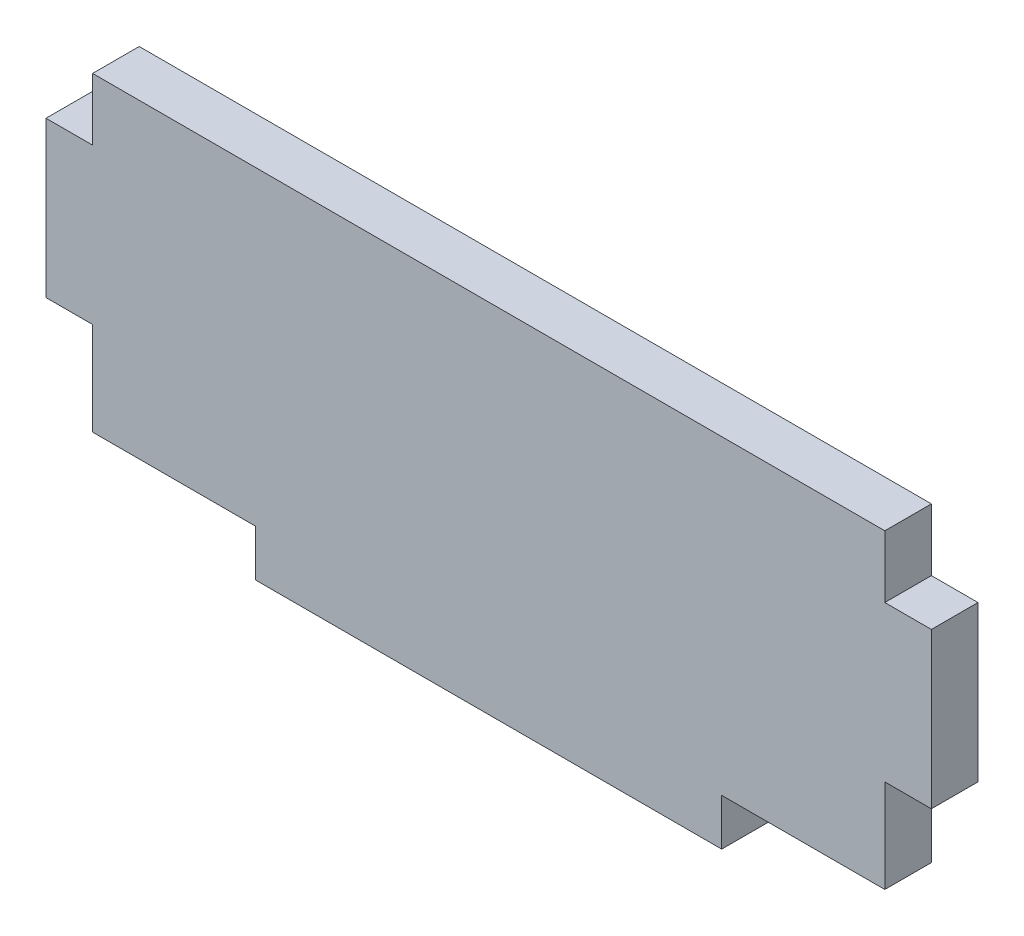
ISO-10303-21;
HEADER;
FILE_DESCRIPTION(('STEP AP214'),'2;1');
FILE_NAME('part.step','',(''),(''),'','','');
FILE_SCHEMA(('AUTOMOTIVE_DESIGN { 1 0 10303 214 1 1 1 1 }'));
ENDSEC;
DATA;
#1=APPLICATION_CONTEXT('core data for automotive mechanical design processes');
#2=APPLICATION_PROTOCOL_DEFINITION('international standard','automotive_design',2000,#1);
#3=PRODUCT_CONTEXT('',#1,'mechanical');
#4=PRODUCT('Part','Part','',(#3));
#5=PRODUCT_RELATED_PRODUCT_CATEGORY('part','',(#4));
#6=PRODUCT_DEFINITION_FORMATION('','',#4);
#7=PRODUCT_DEFINITION_CONTEXT('part definition',#1,'design');
#8=PRODUCT_DEFINITION('design','',#6,#7);
#9=PRODUCT_DEFINITION_SHAPE('','',#8);
#10=(LENGTH_UNIT() NAMED_UNIT(*) SI_UNIT(.MILLI.,.METRE.));
#11=(NAMED_UNIT(*) PLANE_ANGLE_UNIT() SI_UNIT($,.RADIAN.));
#12=(NAMED_UNIT(*) SI_UNIT($,.STERADIAN.) SOLID_ANGLE_UNIT());
#13=UNCERTAINTY_MEASURE_WITH_UNIT(LENGTH_MEASURE(1.E-05),#10,'distance_accuracy_value','');
#14=(GEOMETRIC_REPRESENTATION_CONTEXT(3) GLOBAL_UNCERTAINTY_ASSIGNED_CONTEXT((#13)) GLOBAL_UNIT_ASSIGNED_CONTEXT((#10,
#11,#12)) REPRESENTATION_CONTEXT('',''));
#15=CARTESIAN_POINT('',(0.,0.,0.));
#16=DIRECTION('',(0.,0.,1.));
#17=DIRECTION('',(1.,0.,0.));
#18=AXIS2_PLACEMENT_3D('',#15,#16,#17);
#19=CARTESIAN_POINT('',(15.,-10.,1.5));
#20=DIRECTION('',(0.,1.,0.));
#21=DIRECTION('',(0.,0.,1.));
#22=AXIS2_PLACEMENT_3D('',#19,#20,#21);
#23=PLANE('',#22);
#24=DIRECTION('',(1.,0.,0.));
#25=VECTOR('',#24,1.);
#26=CARTESIAN_POINT('',(15.,-10.,-1.5));
#27=LINE('',#26,#25);
#28=CARTESIAN_POINT('',(15.,-10.,-1.5));
#29=VERTEX_POINT('',#28);
#30=CARTESIAN_POINT('',(25.5,-10.,-1.5));
#31=VERTEX_POINT('',#30);
#32=EDGE_CURVE('E177',#29,#31,#27,.T.);
#33=ORIENTED_EDGE('',*,*,#32,.T.);
#34=DIRECTION('',(0.,0.,-1.));
#35=VECTOR('',#34,1.);
#36=CARTESIAN_POINT('',(25.5,-10.,1.5));
#37=LINE('',#36,#35);
#38=CARTESIAN_POINT('',(25.5,-10.,1.5));
#39=VERTEX_POINT('',#38);
#40=EDGE_CURVE('E11',#39,#31,#37,.T.);
#41=ORIENTED_EDGE('',*,*,#40,.F.);
#42=DIRECTION('',(1.,0.,0.));
#43=VECTOR('',#42,1.);
#44=CARTESIAN_POINT('',(15.,-10.,1.5));
#45=LINE('',#44,#43);
#46=CARTESIAN_POINT('',(15.,-10.,1.5));
#47=VERTEX_POINT('',#46);
#48=EDGE_CURVE('E207',#47,#39,#45,.T.);
#49=ORIENTED_EDGE('',*,*,#48,.F.);
#50=DIRECTION('',(0.,0.,-1.));
#51=VECTOR('',#50,1.);
#52=CARTESIAN_POINT('',(15.,-10.,1.5));
#53=LINE('',#52,#51);
#54=EDGE_CURVE('E173',#47,#29,#53,.T.);
#55=ORIENTED_EDGE('',*,*,#54,.T.);
#56=EDGE_LOOP('',(#33,#41,#49,#55));
#57=FACE_BOUND('',#56,.T.);
#58=ADVANCED_FACE('F33',(#57),#23,.F.);
#59=CARTESIAN_POINT('',(25.5,-4.,1.5));
#60=DIRECTION('',(-1.,0.,0.));
#61=DIRECTION('',(0.,-1.,0.));
#62=AXIS2_PLACEMENT_3D('',#59,#60,#61);
#63=PLANE('',#62);
#64=DIRECTION('',(0.,1.,0.));
#65=VECTOR('',#64,1.);
#66=CARTESIAN_POINT('',(25.5,-4.,-1.5));
#67=LINE('',#66,#65);
#68=CARTESIAN_POINT('',(25.5,-4.,-1.5));
#69=VERTEX_POINT('',#68);
#70=EDGE_CURVE('E180',#31,#69,#67,.T.);
#71=ORIENTED_EDGE('',*,*,#70,.T.);
#72=DIRECTION('',(0.,0.,-1.));
#73=VECTOR('',#72,1.);
#74=CARTESIAN_POINT('',(25.5,-4.,1.5));
#75=LINE('',#74,#73);
#76=CARTESIAN_POINT('',(25.5,-4.,1.5));
#77=VERTEX_POINT('',#76);
#78=EDGE_CURVE('E41',#77,#69,#75,.T.);
#79=ORIENTED_EDGE('',*,*,#78,.F.);
#80=DIRECTION('',(0.,1.,0.));
#81=VECTOR('',#80,1.);
#82=CARTESIAN_POINT('',(25.5,-4.,1.5));
#83=LINE('',#82,#81);
#84=EDGE_CURVE('E116',#39,#77,#83,.T.);
#85=ORIENTED_EDGE('',*,*,#84,.F.);
#86=ORIENTED_EDGE('',*,*,#40,.T.);
#87=EDGE_LOOP('',(#71,#79,#85,#86));
#88=FACE_BOUND('',#87,.T.);
#89=ADVANCED_FACE('F305',(#88),#63,.F.);
#90=CARTESIAN_POINT('',(25.5,-4.,1.5));
#91=DIRECTION('',(0.,1.,0.));
#92=DIRECTION('',(0.,0.,1.));
#93=AXIS2_PLACEMENT_3D('',#90,#91,#92);
#94=PLANE('',#93);
#95=DIRECTION('',(1.,0.,0.));
#96=VECTOR('',#95,1.);
#97=CARTESIAN_POINT('',(25.5,-4.,-1.5));
#98=LINE('',#97,#96);
#99=CARTESIAN_POINT('',(28.5,-4.,-1.5));
#100=VERTEX_POINT('',#99);
#101=EDGE_CURVE('E182',#69,#100,#98,.T.);
#102=ORIENTED_EDGE('',*,*,#101,.T.);
#103=DIRECTION('',(0.,0.,-1.));
#104=VECTOR('',#103,1.);
#105=CARTESIAN_POINT('',(28.5,-4.,1.5));
#106=LINE('',#105,#104);
#107=CARTESIAN_POINT('',(28.5,-4.,1.5));
#108=VERTEX_POINT('',#107);
#109=EDGE_CURVE('E238',#108,#100,#106,.T.);
#110=ORIENTED_EDGE('',*,*,#109,.F.);
#111=DIRECTION('',(1.,0.,0.));
#112=VECTOR('',#111,1.);
#113=CARTESIAN_POINT('',(25.5,-4.,1.5));
#114=LINE('',#113,#112);
#115=EDGE_CURVE('E246',#77,#108,#114,.T.);
#116=ORIENTED_EDGE('',*,*,#115,.F.);
#117=ORIENTED_EDGE('',*,*,#78,.T.);
#118=EDGE_LOOP('',(#102,#110,#116,#117));
#119=FACE_BOUND('',#118,.T.);
#120=ADVANCED_FACE('F244',(#119),#94,.F.);
#121=CARTESIAN_POINT('',(28.5,6.,1.5));
#122=DIRECTION('',(-1.,0.,0.));
#123=DIRECTION('',(0.,0.,1.));
#124=AXIS2_PLACEMENT_3D('',#121,#122,#123);
#125=PLANE('',#124);
#126=DIRECTION('',(0.,1.,0.));
#127=VECTOR('',#126,1.);
#128=CARTESIAN_POINT('',(28.5,6.,-1.5));
#129=LINE('',#128,#127);
#130=CARTESIAN_POINT('',(28.5,6.,-1.5));
#131=VERTEX_POINT('',#130);
#132=EDGE_CURVE('E184',#100,#131,#129,.T.);
#133=ORIENTED_EDGE('',*,*,#132,.T.);
#134=DIRECTION('',(0.,0.,-1.));
#135=VECTOR('',#134,1.);
#136=CARTESIAN_POINT('',(28.5,6.,1.5));
#137=LINE('',#136,#135);
#138=CARTESIAN_POINT('',(28.5,6.,1.5));
#139=VERTEX_POINT('',#138);
#140=EDGE_CURVE('E235',#139,#131,#137,.T.);
#141=ORIENTED_EDGE('',*,*,#140,.F.);
#142=DIRECTION('',(0.,1.,0.));
#143=VECTOR('',#142,1.);
#144=CARTESIAN_POINT('',(28.5,6.,1.5));
#145=LINE('',#144,#143);
#146=EDGE_CURVE('E264',#108,#139,#145,.T.);
#147=ORIENTED_EDGE('',*,*,#146,.F.);
#148=ORIENTED_EDGE('',*,*,#109,.T.);
#149=EDGE_LOOP('',(#133,#141,#147,#148));
#150=FACE_BOUND('',#149,.T.);
#151=ADVANCED_FACE('F255',(#150),#125,.F.);
#152=CARTESIAN_POINT('',(25.5,6.,1.5));
#153=DIRECTION('',(0.,-1.,0.));
#154=DIRECTION('',(0.,0.,-1.));
#155=AXIS2_PLACEMENT_3D('',#152,#153,#154);
#156=PLANE('',#155);
#157=DIRECTION('',(-1.,0.,0.));
#158=VECTOR('',#157,1.);
#159=CARTESIAN_POINT('',(25.5,6.,-1.5));
#160=LINE('',#159,#158);
#161=CARTESIAN_POINT('',(25.5,6.,-1.5));
#162=VERTEX_POINT('',#161);
#163=EDGE_CURVE('E186',#131,#162,#160,.T.);
#164=ORIENTED_EDGE('',*,*,#163,.T.);
#165=DIRECTION('',(0.,0.,-1.));
#166=VECTOR('',#165,1.);
#167=CARTESIAN_POINT('',(25.5,6.,1.5));
#168=LINE('',#167,#166);
#169=CARTESIAN_POINT('',(25.5,6.,1.5));
#170=VERTEX_POINT('',#169);
#171=EDGE_CURVE('E232',#170,#162,#168,.T.);
#172=ORIENTED_EDGE('',*,*,#171,.F.);
#173=DIRECTION('',(-1.,0.,0.));
#174=VECTOR('',#173,1.);
#175=CARTESIAN_POINT('',(25.5,6.,1.5));
#176=LINE('',#175,#174);
#177=EDGE_CURVE('E261',#139,#170,#176,.T.);
#178=ORIENTED_EDGE('',*,*,#177,.F.);
#179=ORIENTED_EDGE('',*,*,#140,.T.);
#180=EDGE_LOOP('',(#164,#172,#178,#179));
#181=FACE_BOUND('',#180,.T.);
#182=ADVANCED_FACE('F259',(#181),#156,.F.);
#183=CARTESIAN_POINT('',(25.5,10.,1.5));
#184=DIRECTION('',(-1.,0.,0.));
#185=DIRECTION('',(0.,0.,1.));
#186=AXIS2_PLACEMENT_3D('',#183,#184,#185);
#187=PLANE('',#186);
#188=DIRECTION('',(0.,1.,0.));
#189=VECTOR('',#188,1.);
#190=CARTESIAN_POINT('',(25.5,10.,-1.5));
#191=LINE('',#190,#189);
#192=CARTESIAN_POINT('',(25.5,10.,-1.5));
#193=VERTEX_POINT('',#192);
#194=EDGE_CURVE('E188',#162,#193,#191,.T.);
#195=ORIENTED_EDGE('',*,*,#194,.T.);
#196=DIRECTION('',(0.,0.,-1.));
#197=VECTOR('',#196,1.);
#198=CARTESIAN_POINT('',(25.5,10.,1.5));
#199=LINE('',#198,#197);
#200=CARTESIAN_POINT('',(25.5,10.,1.5));
#201=VERTEX_POINT('',#200);
#202=EDGE_CURVE('E229',#201,#193,#199,.T.);
#203=ORIENTED_EDGE('',*,*,#202,.F.);
#204=DIRECTION('',(0.,1.,0.));
#205=VECTOR('',#204,1.);
#206=CARTESIAN_POINT('',(25.5,10.,1.5));
#207=LINE('',#206,#205);
#208=EDGE_CURVE('E263',#170,#201,#207,.T.);
#209=ORIENTED_EDGE('',*,*,#208,.F.);
#210=ORIENTED_EDGE('',*,*,#171,.T.);
#211=EDGE_LOOP('',(#195,#203,#209,#210));
#212=FACE_BOUND('',#211,.T.);
#213=ADVANCED_FACE('F318',(#212),#187,.F.);
#214=CARTESIAN_POINT('',(-25.5,10.,1.5));
#215=DIRECTION('',(0.,-1.,0.));
#216=DIRECTION('',(0.,0.,-1.));
#217=AXIS2_PLACEMENT_3D('',#214,#215,#216);
#218=PLANE('',#217);
#219=DIRECTION('',(-1.,0.,0.));
#220=VECTOR('',#219,1.);
#221=CARTESIAN_POINT('',(-25.5,10.,-1.5));
#222=LINE('',#221,#220);
#223=CARTESIAN_POINT('',(-25.5,10.,-1.5));
#224=VERTEX_POINT('',#223);
#225=EDGE_CURVE('E190',#193,#224,#222,.T.);
#226=ORIENTED_EDGE('',*,*,#225,.T.);
#227=DIRECTION('',(0.,0.,-1.));
#228=VECTOR('',#227,1.);
#229=CARTESIAN_POINT('',(-25.5,10.,1.5));
#230=LINE('',#229,#228);
#231=CARTESIAN_POINT('',(-25.5,10.,1.5));
#232=VERTEX_POINT('',#231);
#233=EDGE_CURVE('E226',#232,#224,#230,.T.);
#234=ORIENTED_EDGE('',*,*,#233,.F.);
#235=DIRECTION('',(-1.,0.,0.));
#236=VECTOR('',#235,1.);
#237=CARTESIAN_POINT('',(-25.5,10.,1.5));
#238=LINE('',#237,#236);
#239=EDGE_CURVE('E266',#201,#232,#238,.T.);
#240=ORIENTED_EDGE('',*,*,#239,.F.);
#241=ORIENTED_EDGE('',*,*,#202,.T.);
#242=EDGE_LOOP('',(#226,#234,#240,#241));
#243=FACE_BOUND('',#242,.T.);
#244=ADVANCED_FACE('F321',(#243),#218,.F.);
#245=CARTESIAN_POINT('',(-25.5,10.,1.5));
#246=DIRECTION('',(1.,0.,0.));
#247=DIRECTION('',(0.,0.,-1.));
#248=AXIS2_PLACEMENT_3D('',#245,#246,#247);
#249=PLANE('',#248);
#250=DIRECTION('',(0.,-1.,0.));
#251=VECTOR('',#250,1.);
#252=CARTESIAN_POINT('',(-25.5,10.,-1.5));
#253=LINE('',#252,#251);
#254=CARTESIAN_POINT('',(-25.5,6.,-1.5));
#255=VERTEX_POINT('',#254);
#256=EDGE_CURVE('E192',#224,#255,#253,.T.);
#257=ORIENTED_EDGE('',*,*,#256,.T.);
#258=DIRECTION('',(0.,0.,-1.));
#259=VECTOR('',#258,1.);
#260=CARTESIAN_POINT('',(-25.5,6.,1.5));
#261=LINE('',#260,#259);
#262=CARTESIAN_POINT('',(-25.5,6.,1.5));
#263=VERTEX_POINT('',#262);
#264=EDGE_CURVE('E223',#263,#255,#261,.T.);
#265=ORIENTED_EDGE('',*,*,#264,.F.);
#266=DIRECTION('',(0.,-1.,0.));
#267=VECTOR('',#266,1.);
#268=CARTESIAN_POINT('',(-25.5,10.,1.5));
#269=LINE('',#268,#267);
#270=EDGE_CURVE('E272',#232,#263,#269,.T.);
#271=ORIENTED_EDGE('',*,*,#270,.F.);
#272=ORIENTED_EDGE('',*,*,#233,.T.);
#273=EDGE_LOOP('',(#257,#265,#271,#272));
#274=FACE_BOUND('',#273,.T.);
#275=ADVANCED_FACE('F325',(#274),#249,.F.);
#276=CARTESIAN_POINT('',(-25.5,6.,1.5));
#277=DIRECTION('',(0.,-1.,0.));
#278=DIRECTION('',(1.,0.,0.));
#279=AXIS2_PLACEMENT_3D('',#276,#277,#278);
#280=PLANE('',#279);
#281=DIRECTION('',(-1.,0.,0.));
#282=VECTOR('',#281,1.);
#283=CARTESIAN_POINT('',(-25.5,6.,-1.5));
#284=LINE('',#283,#282);
#285=CARTESIAN_POINT('',(-28.5,6.,-1.5));
#286=VERTEX_POINT('',#285);
#287=EDGE_CURVE('E194',#255,#286,#284,.T.);
#288=ORIENTED_EDGE('',*,*,#287,.T.);
#289=DIRECTION('',(0.,0.,-1.));
#290=VECTOR('',#289,1.);
#291=CARTESIAN_POINT('',(-28.5,6.,1.5));
#292=LINE('',#291,#290);
#293=CARTESIAN_POINT('',(-28.5,6.,1.5));
#294=VERTEX_POINT('',#293);
#295=EDGE_CURVE('E220',#294,#286,#292,.T.);
#296=ORIENTED_EDGE('',*,*,#295,.F.);
#297=DIRECTION('',(-1.,0.,0.));
#298=VECTOR('',#297,1.);
#299=CARTESIAN_POINT('',(-25.5,6.,1.5));
#300=LINE('',#299,#298);
#301=EDGE_CURVE('E274',#263,#294,#300,.T.);
#302=ORIENTED_EDGE('',*,*,#301,.F.);
#303=ORIENTED_EDGE('',*,*,#264,.T.);
#304=EDGE_LOOP('',(#288,#296,#302,#303));
#305=FACE_BOUND('',#304,.T.);
#306=ADVANCED_FACE('F329',(#305),#280,.F.);
#307=CARTESIAN_POINT('',(-28.5,6.,1.5));
#308=DIRECTION('',(1.,0.,0.));
#309=DIRECTION('',(0.,1.,0.));
#310=AXIS2_PLACEMENT_3D('',#307,#308,#309);
#311=PLANE('',#310);
#312=DIRECTION('',(0.,-1.,0.));
#313=VECTOR('',#312,1.);
#314=CARTESIAN_POINT('',(-28.5,6.,-1.5));
#315=LINE('',#314,#313);
#316=CARTESIAN_POINT('',(-28.5,-4.,-1.5));
#317=VERTEX_POINT('',#316);
#318=EDGE_CURVE('E196',#286,#317,#315,.T.);
#319=ORIENTED_EDGE('',*,*,#318,.T.);
#320=DIRECTION('',(0.,0.,-1.));
#321=VECTOR('',#320,1.);
#322=CARTESIAN_POINT('',(-28.5,-4.,1.5));
#323=LINE('',#322,#321);
#324=CARTESIAN_POINT('',(-28.5,-4.,1.5));
#325=VERTEX_POINT('',#324);
#326=EDGE_CURVE('E217',#325,#317,#323,.T.);
#327=ORIENTED_EDGE('',*,*,#326,.F.);
#328=DIRECTION('',(0.,-1.,0.));
#329=VECTOR('',#328,1.);
#330=CARTESIAN_POINT('',(-28.5,6.,1.5));
#331=LINE('',#330,#329);
#332=EDGE_CURVE('E276',#294,#325,#331,.T.);
#333=ORIENTED_EDGE('',*,*,#332,.F.);
#334=ORIENTED_EDGE('',*,*,#295,.T.);
#335=EDGE_LOOP('',(#319,#327,#333,#334));
#336=FACE_BOUND('',#335,.T.);
#337=ADVANCED_FACE('F333',(#336),#311,.F.);
#338=CARTESIAN_POINT('',(-25.5,-4.,1.5));
#339=DIRECTION('',(0.,1.,0.));
#340=DIRECTION('',(-1.,0.,0.));
#341=AXIS2_PLACEMENT_3D('',#338,#339,#340);
#342=PLANE('',#341);
#343=DIRECTION('',(1.,0.,0.));
#344=VECTOR('',#343,1.);
#345=CARTESIAN_POINT('',(-25.5,-4.,-1.5));
#346=LINE('',#345,#344);
#347=CARTESIAN_POINT('',(-25.5,-4.,-1.5));
#348=VERTEX_POINT('',#347);
#349=EDGE_CURVE('E198',#317,#348,#346,.T.);
#350=ORIENTED_EDGE('',*,*,#349,.T.);
#351=DIRECTION('',(0.,0.,-1.));
#352=VECTOR('',#351,1.);
#353=CARTESIAN_POINT('',(-25.5,-4.,1.5));
#354=LINE('',#353,#352);
#355=CARTESIAN_POINT('',(-25.5,-4.,1.5));
#356=VERTEX_POINT('',#355);
#357=EDGE_CURVE('E214',#356,#348,#354,.T.);
#358=ORIENTED_EDGE('',*,*,#357,.F.);
#359=DIRECTION('',(1.,0.,0.));
#360=VECTOR('',#359,1.);
#361=CARTESIAN_POINT('',(-25.5,-4.,1.5));
#362=LINE('',#361,#360);
#363=EDGE_CURVE('E278',#325,#356,#362,.T.);
#364=ORIENTED_EDGE('',*,*,#363,.F.);
#365=ORIENTED_EDGE('',*,*,#326,.T.);
#366=EDGE_LOOP('',(#350,#358,#364,#365));
#367=FACE_BOUND('',#366,.T.);
#368=ADVANCED_FACE('F337',(#367),#342,.F.);
#369=CARTESIAN_POINT('',(-25.5,-4.,1.5));
#370=DIRECTION('',(1.,0.,0.));
#371=DIRECTION('',(0.,0.,-1.));
#372=AXIS2_PLACEMENT_3D('',#369,#370,#371);
#373=PLANE('',#372);
#374=DIRECTION('',(0.,-1.,0.));
#375=VECTOR('',#374,1.);
#376=CARTESIAN_POINT('',(-25.5,-4.,-1.5));
#377=LINE('',#376,#375);
#378=CARTESIAN_POINT('',(-25.5,-10.,-1.5));
#379=VERTEX_POINT('',#378);
#380=EDGE_CURVE('E200',#348,#379,#377,.T.);
#381=ORIENTED_EDGE('',*,*,#380,.T.);
#382=DIRECTION('',(0.,0.,-1.));
#383=VECTOR('',#382,1.);
#384=CARTESIAN_POINT('',(-25.5,-10.,1.5));
#385=LINE('',#384,#383);
#386=CARTESIAN_POINT('',(-25.5,-10.,1.5));
#387=VERTEX_POINT('',#386);
#388=EDGE_CURVE('E211',#387,#379,#385,.T.);
#389=ORIENTED_EDGE('',*,*,#388,.F.);
#390=DIRECTION('',(0.,-1.,0.));
#391=VECTOR('',#390,1.);
#392=CARTESIAN_POINT('',(-25.5,-4.,1.5));
#393=LINE('',#392,#391);
#394=EDGE_CURVE('E280',#356,#387,#393,.T.);
#395=ORIENTED_EDGE('',*,*,#394,.F.);
#396=ORIENTED_EDGE('',*,*,#357,.T.);
#397=EDGE_LOOP('',(#381,#389,#395,#396));
#398=FACE_BOUND('',#397,.T.);
#399=ADVANCED_FACE('F286',(#398),#373,.F.);
#400=CARTESIAN_POINT('',(-25.5,-10.,1.5));
#401=DIRECTION('',(0.,1.,0.));
#402=DIRECTION('',(0.,0.,1.));
#403=AXIS2_PLACEMENT_3D('',#400,#401,#402);
#404=PLANE('',#403);
#405=DIRECTION('',(1.,0.,0.));
#406=VECTOR('',#405,1.);
#407=CARTESIAN_POINT('',(-25.5,-10.,-1.5));
#408=LINE('',#407,#406);
#409=CARTESIAN_POINT('',(-15.,-10.,-1.5));
#410=VERTEX_POINT('',#409);
#411=EDGE_CURVE('E202',#379,#410,#408,.T.);
#412=ORIENTED_EDGE('',*,*,#411,.T.);
#413=DIRECTION('',(0.,0.,-1.));
#414=VECTOR('',#413,1.);
#415=CARTESIAN_POINT('',(-15.,-10.,1.5));
#416=LINE('',#415,#414);
#417=CARTESIAN_POINT('',(-15.,-10.,1.5));
#418=VERTEX_POINT('',#417);
#419=EDGE_CURVE('E168',#418,#410,#416,.T.);
#420=ORIENTED_EDGE('',*,*,#419,.F.);
#421=DIRECTION('',(1.,0.,0.));
#422=VECTOR('',#421,1.);
#423=CARTESIAN_POINT('',(-25.5,-10.,1.5));
#424=LINE('',#423,#422);
#425=EDGE_CURVE('E159',#387,#418,#424,.T.);
#426=ORIENTED_EDGE('',*,*,#425,.F.);
#427=ORIENTED_EDGE('',*,*,#388,.T.);
#428=EDGE_LOOP('',(#412,#420,#426,#427));
#429=FACE_BOUND('',#428,.T.);
#430=ADVANCED_FACE('F290',(#429),#404,.F.);
#431=CARTESIAN_POINT('',(-15.,-10.,1.5));
#432=DIRECTION('',(1.,0.,0.));
#433=DIRECTION('',(0.,0.,-1.));
#434=AXIS2_PLACEMENT_3D('',#431,#432,#433);
#435=PLANE('',#434);
#436=DIRECTION('',(0.,-1.,0.));
#437=VECTOR('',#436,1.);
#438=CARTESIAN_POINT('',(-15.,-10.,-1.5));
#439=LINE('',#438,#437);
#440=CARTESIAN_POINT('',(-15.,-13.,-1.5));
#441=VERTEX_POINT('',#440);
#442=EDGE_CURVE('E167',#410,#441,#439,.T.);
#443=ORIENTED_EDGE('',*,*,#442,.T.);
#444=DIRECTION('',(0.,0.,-1.));
#445=VECTOR('',#444,1.);
#446=CARTESIAN_POINT('',(-15.,-13.,1.5));
#447=LINE('',#446,#445);
#448=CARTESIAN_POINT('',(-15.,-13.,1.5));
#449=VERTEX_POINT('',#448);
#450=EDGE_CURVE('E164',#449,#441,#447,.T.);
#451=ORIENTED_EDGE('',*,*,#450,.F.);
#452=DIRECTION('',(0.,-1.,0.));
#453=VECTOR('',#452,1.);
#454=CARTESIAN_POINT('',(-15.,-10.,1.5));
#455=LINE('',#454,#453);
#456=EDGE_CURVE('E153',#418,#449,#455,.T.);
#457=ORIENTED_EDGE('',*,*,#456,.F.);
#458=ORIENTED_EDGE('',*,*,#419,.T.);
#459=EDGE_LOOP('',(#443,#451,#457,#458));
#460=FACE_BOUND('',#459,.T.);
#461=ADVANCED_FACE('F165',(#460),#435,.F.);
#462=CARTESIAN_POINT('',(-15.,-13.,1.5));
#463=DIRECTION('',(0.,1.,0.));
#464=DIRECTION('',(-1.,0.,0.));
#465=AXIS2_PLACEMENT_3D('',#462,#463,#464);
#466=PLANE('',#465);
#467=DIRECTION('',(1.,0.,0.));
#468=VECTOR('',#467,1.);
#469=CARTESIAN_POINT('',(-15.,-13.,-1.5));
#470=LINE('',#469,#468);
#471=CARTESIAN_POINT('',(15.,-13.,-1.5));
#472=VERTEX_POINT('',#471);
#473=EDGE_CURVE('E102',#441,#472,#470,.T.);
#474=ORIENTED_EDGE('',*,*,#473,.T.);
#475=DIRECTION('',(0.,0.,-1.));
#476=VECTOR('',#475,1.);
#477=CARTESIAN_POINT('',(15.,-13.,1.5));
#478=LINE('',#477,#476);
#479=CARTESIAN_POINT('',(15.,-13.,1.5));
#480=VERTEX_POINT('',#479);
#481=EDGE_CURVE('E169',#480,#472,#478,.T.);
#482=ORIENTED_EDGE('',*,*,#481,.F.);
#483=DIRECTION('',(1.,0.,0.));
#484=VECTOR('',#483,1.);
#485=CARTESIAN_POINT('',(-15.,-13.,1.5));
#486=LINE('',#485,#484);
#487=EDGE_CURVE('E157',#449,#480,#486,.T.);
#488=ORIENTED_EDGE('',*,*,#487,.F.);
#489=ORIENTED_EDGE('',*,*,#450,.T.);
#490=EDGE_LOOP('',(#474,#482,#488,#489));
#491=FACE_BOUND('',#490,.T.);
#492=ADVANCED_FACE('F171',(#491),#466,.F.);
#493=CARTESIAN_POINT('',(15.,-10.,1.5));
#494=DIRECTION('',(-1.,0.,0.));
#495=DIRECTION('',(0.,0.,1.));
#496=AXIS2_PLACEMENT_3D('',#493,#494,#495);
#497=PLANE('',#496);
#498=DIRECTION('',(0.,1.,0.));
#499=VECTOR('',#498,1.);
#500=CARTESIAN_POINT('',(15.,-10.,-1.5));
#501=LINE('',#500,#499);
#502=EDGE_CURVE('E108',#472,#29,#501,.T.);
#503=ORIENTED_EDGE('',*,*,#502,.T.);
#504=ORIENTED_EDGE('',*,*,#54,.F.);
#505=DIRECTION('',(0.,1.,0.));
#506=VECTOR('',#505,1.);
#507=CARTESIAN_POINT('',(15.,-10.,1.5));
#508=LINE('',#507,#506);
#509=EDGE_CURVE('E49',#480,#47,#508,.T.);
#510=ORIENTED_EDGE('',*,*,#509,.F.);
#511=ORIENTED_EDGE('',*,*,#481,.T.);
#512=EDGE_LOOP('',(#503,#504,#510,#511));
#513=FACE_BOUND('',#512,.T.);
#514=ADVANCED_FACE('F294',(#513),#497,.F.);
#515=CARTESIAN_POINT('',(0.,0.,1.5));
#516=DIRECTION('',(0.,0.,-1.));
#517=DIRECTION('',(-1.,0.,0.));
#518=AXIS2_PLACEMENT_3D('',#515,#516,#517);
#519=PLANE('',#518);
#520=ORIENTED_EDGE('',*,*,#48,.T.);
#521=ORIENTED_EDGE('',*,*,#84,.T.);
#522=ORIENTED_EDGE('',*,*,#115,.T.);
#523=ORIENTED_EDGE('',*,*,#146,.T.);
#524=ORIENTED_EDGE('',*,*,#177,.T.);
#525=ORIENTED_EDGE('',*,*,#208,.T.);
#526=ORIENTED_EDGE('',*,*,#239,.T.);
#527=ORIENTED_EDGE('',*,*,#270,.T.);
#528=ORIENTED_EDGE('',*,*,#301,.T.);
#529=ORIENTED_EDGE('',*,*,#332,.T.);
#530=ORIENTED_EDGE('',*,*,#363,.T.);
#531=ORIENTED_EDGE('',*,*,#394,.T.);
#532=ORIENTED_EDGE('',*,*,#425,.T.);
#533=ORIENTED_EDGE('',*,*,#456,.T.);
#534=ORIENTED_EDGE('',*,*,#487,.T.);
#535=ORIENTED_EDGE('',*,*,#509,.T.);
#536=EDGE_LOOP('',(#520,#521,#522,#523,#524,#525,#526,#527,#528,#529,#530,#531,#532,#533,#534,#535));
#537=FACE_BOUND('',#536,.T.);
#538=ADVANCED_FACE('F155',(#537),#519,.F.);
#539=CARTESIAN_POINT('',(0.,0.,-1.5));
#540=DIRECTION('',(0.,0.,-1.));
#541=DIRECTION('',(-1.,0.,0.));
#542=AXIS2_PLACEMENT_3D('',#539,#540,#541);
#543=PLANE('',#542);
#544=ORIENTED_EDGE('',*,*,#32,.F.);
#545=ORIENTED_EDGE('',*,*,#502,.F.);
#546=ORIENTED_EDGE('',*,*,#473,.F.);
#547=ORIENTED_EDGE('',*,*,#442,.F.);
#548=ORIENTED_EDGE('',*,*,#411,.F.);
#549=ORIENTED_EDGE('',*,*,#380,.F.);
#550=ORIENTED_EDGE('',*,*,#349,.F.);
#551=ORIENTED_EDGE('',*,*,#318,.F.);
#552=ORIENTED_EDGE('',*,*,#287,.F.);
#553=ORIENTED_EDGE('',*,*,#256,.F.);
#554=ORIENTED_EDGE('',*,*,#225,.F.);
#555=ORIENTED_EDGE('',*,*,#194,.F.);
#556=ORIENTED_EDGE('',*,*,#163,.F.);
#557=ORIENTED_EDGE('',*,*,#132,.F.);
#558=ORIENTED_EDGE('',*,*,#101,.F.);
#559=ORIENTED_EDGE('',*,*,#70,.F.);
#560=EDGE_LOOP('',(#544,#545,#546,#547,#548,#549,#550,#551,#552,#553,#554,#555,#556,#557,#558,#559));
#561=FACE_BOUND('',#560,.T.);
#562=ADVANCED_FACE('F250',(#561),#543,.T.);
#563=CLOSED_SHELL('',(#58,#89,#120,#151,#182,#213,#244,#275,#306,#337,#368,#399,#430,#461,#492,
#514,#538,#562));
#564=MANIFOLD_SOLID_BREP('B2',#563);
#565=ADVANCED_BREP_SHAPE_REPRESENTATION('',(#18,#564),#14);
#566=SHAPE_DEFINITION_REPRESENTATION(#9,#565);
ENDSEC;
END-ISO-10303-21;
